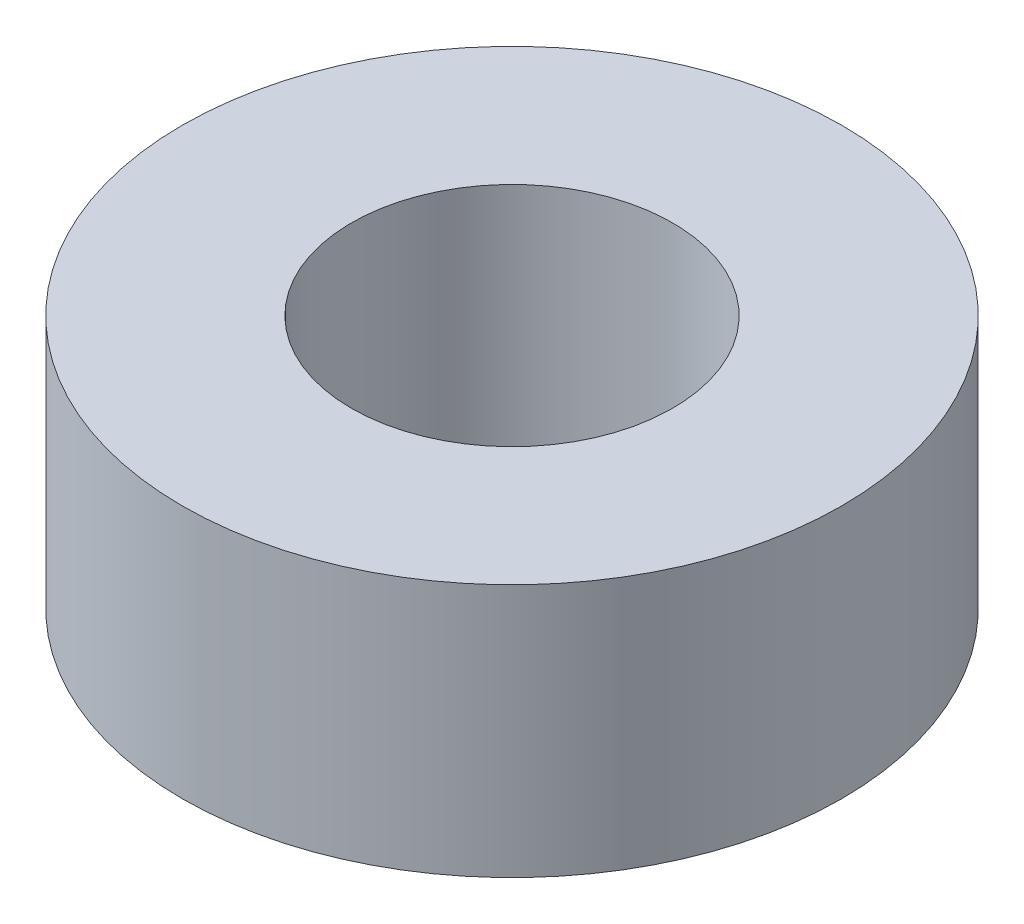
ISO-10303-21;
HEADER;
FILE_DESCRIPTION(('STEP AP214'),'2;1');
FILE_NAME('part.step','',(''),(''),'','','');
FILE_SCHEMA(('AUTOMOTIVE_DESIGN { 1 0 10303 214 1 1 1 1 }'));
ENDSEC;
DATA;
#1=APPLICATION_CONTEXT('core data for automotive mechanical design processes');
#2=APPLICATION_PROTOCOL_DEFINITION('international standard','automotive_design',2000,#1);
#3=PRODUCT_CONTEXT('',#1,'mechanical');
#4=PRODUCT('Part','Part','',(#3));
#5=PRODUCT_RELATED_PRODUCT_CATEGORY('part','',(#4));
#6=PRODUCT_DEFINITION_FORMATION('','',#4);
#7=PRODUCT_DEFINITION_CONTEXT('part definition',#1,'design');
#8=PRODUCT_DEFINITION('design','',#6,#7);
#9=PRODUCT_DEFINITION_SHAPE('','',#8);
#10=(LENGTH_UNIT() NAMED_UNIT(*) SI_UNIT(.MILLI.,.METRE.));
#11=(NAMED_UNIT(*) PLANE_ANGLE_UNIT() SI_UNIT($,.RADIAN.));
#12=(NAMED_UNIT(*) SI_UNIT($,.STERADIAN.) SOLID_ANGLE_UNIT());
#13=UNCERTAINTY_MEASURE_WITH_UNIT(LENGTH_MEASURE(1.E-05),#10,'distance_accuracy_value','');
#14=(GEOMETRIC_REPRESENTATION_CONTEXT(3) GLOBAL_UNCERTAINTY_ASSIGNED_CONTEXT((#13)) GLOBAL_UNIT_ASSIGNED_CONTEXT((#10,
#11,#12)) REPRESENTATION_CONTEXT('',''));
#15=CARTESIAN_POINT('',(0.,0.,0.));
#16=DIRECTION('',(0.,0.,1.));
#17=DIRECTION('',(1.,0.,0.));
#18=AXIS2_PLACEMENT_3D('',#15,#16,#17);
#19=CARTESIAN_POINT('',(0.,3.,0.));
#20=DIRECTION('',(0.,1.,0.));
#21=DIRECTION('',(0.,0.,1.));
#22=AXIS2_PLACEMENT_3D('',#19,#20,#21);
#23=PLANE('',#22);
#24=CARTESIAN_POINT('',(0.,3.,0.));
#25=DIRECTION('',(0.,1.,0.));
#26=DIRECTION('',(1.,0.,0.));
#27=AXIS2_PLACEMENT_3D('',#24,#25,#26);
#28=CIRCLE('',#27,3.9);
#29=CARTESIAN_POINT('',(3.9,3.,0.));
#30=VERTEX_POINT('',#29);
#31=EDGE_CURVE('E11',#30,#30,#28,.T.);
#32=ORIENTED_EDGE('',*,*,#31,.T.);
#33=EDGE_LOOP('',(#32));
#34=FACE_BOUND('',#33,.T.);
#35=CARTESIAN_POINT('',(0.,3.,0.));
#36=DIRECTION('',(0.,1.,0.));
#37=DIRECTION('',(0.,0.,1.));
#38=AXIS2_PLACEMENT_3D('',#35,#36,#37);
#39=CIRCLE('',#38,1.9);
#40=CARTESIAN_POINT('',(0.,3.,1.9));
#41=VERTEX_POINT('',#40);
#42=EDGE_CURVE('E56',#41,#41,#39,.T.);
#43=ORIENTED_EDGE('',*,*,#42,.F.);
#44=EDGE_LOOP('',(#43));
#45=FACE_BOUND('',#44,.T.);
#46=ADVANCED_FACE('F45',(#34,#45),#23,.T.);
#47=CARTESIAN_POINT('',(0.,0.,0.));
#48=DIRECTION('',(0.,1.,0.));
#49=DIRECTION('',(0.,0.,1.));
#50=AXIS2_PLACEMENT_3D('',#47,#48,#49);
#51=PLANE('',#50);
#52=CARTESIAN_POINT('',(0.,0.,0.));
#53=DIRECTION('',(0.,1.,0.));
#54=DIRECTION('',(1.,0.,0.));
#55=AXIS2_PLACEMENT_3D('',#52,#53,#54);
#56=CIRCLE('',#55,3.9);
#57=CARTESIAN_POINT('',(3.9,0.,0.));
#58=VERTEX_POINT('',#57);
#59=EDGE_CURVE('E49',#58,#58,#56,.T.);
#60=ORIENTED_EDGE('',*,*,#59,.F.);
#61=EDGE_LOOP('',(#60));
#62=FACE_BOUND('',#61,.T.);
#63=CARTESIAN_POINT('',(0.,0.,0.));
#64=DIRECTION('',(0.,1.,0.));
#65=DIRECTION('',(0.,0.,1.));
#66=AXIS2_PLACEMENT_3D('',#63,#64,#65);
#67=CIRCLE('',#66,1.9);
#68=CARTESIAN_POINT('',(0.,0.,1.9));
#69=VERTEX_POINT('',#68);
#70=EDGE_CURVE('E58',#69,#69,#67,.T.);
#71=ORIENTED_EDGE('',*,*,#70,.T.);
#72=EDGE_LOOP('',(#71));
#73=FACE_BOUND('',#72,.T.);
#74=ADVANCED_FACE('F68',(#62,#73),#51,.F.);
#75=CARTESIAN_POINT('',(0.,3.,0.));
#76=DIRECTION('',(0.,-1.,0.));
#77=DIRECTION('',(0.,0.,-1.));
#78=AXIS2_PLACEMENT_3D('',#75,#76,#77);
#79=CYLINDRICAL_SURFACE('',#78,3.9);
#80=ORIENTED_EDGE('',*,*,#31,.F.);
#81=EDGE_LOOP('',(#80));
#82=FACE_BOUND('',#81,.T.);
#83=ORIENTED_EDGE('',*,*,#59,.T.);
#84=EDGE_LOOP('',(#83));
#85=FACE_BOUND('',#84,.T.);
#86=ADVANCED_FACE('F47',(#82,#85),#79,.T.);
#87=CARTESIAN_POINT('',(0.,3.,0.));
#88=DIRECTION('',(0.,-1.,0.));
#89=DIRECTION('',(0.,0.,-1.));
#90=AXIS2_PLACEMENT_3D('',#87,#88,#89);
#91=CYLINDRICAL_SURFACE('',#90,1.9);
#92=ORIENTED_EDGE('',*,*,#42,.T.);
#93=EDGE_LOOP('',(#92));
#94=FACE_BOUND('',#93,.T.);
#95=ORIENTED_EDGE('',*,*,#70,.F.);
#96=EDGE_LOOP('',(#95));
#97=FACE_BOUND('',#96,.T.);
#98=ADVANCED_FACE('F64',(#94,#97),#91,.F.);
#99=CLOSED_SHELL('',(#46,#74,#86,#98));
#100=MANIFOLD_SOLID_BREP('B2',#99);
#101=ADVANCED_BREP_SHAPE_REPRESENTATION('',(#18,#100),#14);
#102=SHAPE_DEFINITION_REPRESENTATION(#9,#101);
ENDSEC;
END-ISO-10303-21;
